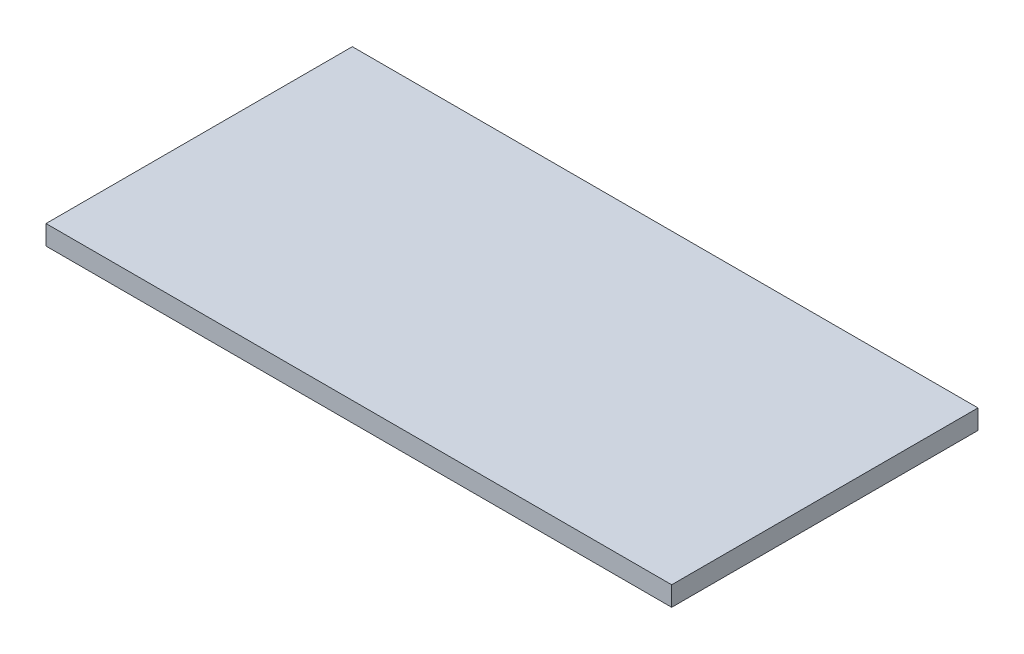
ISO-10303-21;
HEADER;
FILE_DESCRIPTION(('STEP AP214'),'2;1');
FILE_NAME('part.step','',(''),(''),'','','');
FILE_SCHEMA(('AUTOMOTIVE_DESIGN { 1 0 10303 214 1 1 1 1 }'));
ENDSEC;
DATA;
#1=APPLICATION_CONTEXT('core data for automotive mechanical design processes');
#2=APPLICATION_PROTOCOL_DEFINITION('international standard','automotive_design',2000,#1);
#3=PRODUCT_CONTEXT('',#1,'mechanical');
#4=PRODUCT('Part','Part','',(#3));
#5=PRODUCT_RELATED_PRODUCT_CATEGORY('part','',(#4));
#6=PRODUCT_DEFINITION_FORMATION('','',#4);
#7=PRODUCT_DEFINITION_CONTEXT('part definition',#1,'design');
#8=PRODUCT_DEFINITION('design','',#6,#7);
#9=PRODUCT_DEFINITION_SHAPE('','',#8);
#10=(LENGTH_UNIT() NAMED_UNIT(*) SI_UNIT(.MILLI.,.METRE.));
#11=(NAMED_UNIT(*) PLANE_ANGLE_UNIT() SI_UNIT($,.RADIAN.));
#12=(NAMED_UNIT(*) SI_UNIT($,.STERADIAN.) SOLID_ANGLE_UNIT());
#13=UNCERTAINTY_MEASURE_WITH_UNIT(LENGTH_MEASURE(1.E-05),#10,'distance_accuracy_value','');
#14=(GEOMETRIC_REPRESENTATION_CONTEXT(3) GLOBAL_UNCERTAINTY_ASSIGNED_CONTEXT((#13)) GLOBAL_UNIT_ASSIGNED_CONTEXT((#10,
#11,#12)) REPRESENTATION_CONTEXT('',''));
#15=CARTESIAN_POINT('',(0.,0.,0.));
#16=DIRECTION('',(0.,0.,1.));
#17=DIRECTION('',(1.,0.,0.));
#18=AXIS2_PLACEMENT_3D('',#15,#16,#17);
#19=CARTESIAN_POINT('',(-288.,18.,141.));
#20=DIRECTION('',(1.,0.,0.));
#21=DIRECTION('',(0.,0.,-1.));
#22=AXIS2_PLACEMENT_3D('',#19,#20,#21);
#23=PLANE('',#22);
#24=DIRECTION('',(0.,0.,1.));
#25=VECTOR('',#24,1.);
#26=CARTESIAN_POINT('',(-288.,0.,141.));
#27=LINE('',#26,#25);
#28=CARTESIAN_POINT('',(-288.,0.,-141.));
#29=VERTEX_POINT('',#28);
#30=CARTESIAN_POINT('',(-288.,0.,141.));
#31=VERTEX_POINT('',#30);
#32=EDGE_CURVE('E98',#29,#31,#27,.T.);
#33=ORIENTED_EDGE('',*,*,#32,.T.);
#34=DIRECTION('',(0.,-1.,0.));
#35=VECTOR('',#34,1.);
#36=CARTESIAN_POINT('',(-288.,18.,141.));
#37=LINE('',#36,#35);
#38=CARTESIAN_POINT('',(-288.,18.,141.));
#39=VERTEX_POINT('',#38);
#40=EDGE_CURVE('E11',#39,#31,#37,.T.);
#41=ORIENTED_EDGE('',*,*,#40,.F.);
#42=DIRECTION('',(0.,0.,1.));
#43=VECTOR('',#42,1.);
#44=CARTESIAN_POINT('',(-288.,18.,141.));
#45=LINE('',#44,#43);
#46=CARTESIAN_POINT('',(-288.,18.,-141.));
#47=VERTEX_POINT('',#46);
#48=EDGE_CURVE('E86',#47,#39,#45,.T.);
#49=ORIENTED_EDGE('',*,*,#48,.F.);
#50=DIRECTION('',(0.,-1.,0.));
#51=VECTOR('',#50,1.);
#52=CARTESIAN_POINT('',(-288.,18.,-141.));
#53=LINE('',#52,#51);
#54=EDGE_CURVE('E94',#47,#29,#53,.T.);
#55=ORIENTED_EDGE('',*,*,#54,.T.);
#56=EDGE_LOOP('',(#33,#41,#49,#55));
#57=FACE_BOUND('',#56,.T.);
#58=ADVANCED_FACE('F35',(#57),#23,.F.);
#59=CARTESIAN_POINT('',(288.,18.,141.));
#60=DIRECTION('',(0.,0.,-1.));
#61=DIRECTION('',(-1.,0.,0.));
#62=AXIS2_PLACEMENT_3D('',#59,#60,#61);
#63=PLANE('',#62);
#64=DIRECTION('',(1.,0.,0.));
#65=VECTOR('',#64,1.);
#66=CARTESIAN_POINT('',(288.,0.,141.));
#67=LINE('',#66,#65);
#68=CARTESIAN_POINT('',(288.,0.,141.));
#69=VERTEX_POINT('',#68);
#70=EDGE_CURVE('E90',#31,#69,#67,.T.);
#71=ORIENTED_EDGE('',*,*,#70,.T.);
#72=DIRECTION('',(0.,-1.,0.));
#73=VECTOR('',#72,1.);
#74=CARTESIAN_POINT('',(288.,18.,141.));
#75=LINE('',#74,#73);
#76=CARTESIAN_POINT('',(288.,18.,141.));
#77=VERTEX_POINT('',#76);
#78=EDGE_CURVE('E43',#77,#69,#75,.T.);
#79=ORIENTED_EDGE('',*,*,#78,.F.);
#80=DIRECTION('',(1.,0.,0.));
#81=VECTOR('',#80,1.);
#82=CARTESIAN_POINT('',(288.,18.,141.));
#83=LINE('',#82,#81);
#84=EDGE_CURVE('E81',#39,#77,#83,.T.);
#85=ORIENTED_EDGE('',*,*,#84,.F.);
#86=ORIENTED_EDGE('',*,*,#40,.T.);
#87=EDGE_LOOP('',(#71,#79,#85,#86));
#88=FACE_BOUND('',#87,.T.);
#89=ADVANCED_FACE('F89',(#88),#63,.F.);
#90=CARTESIAN_POINT('',(288.,18.,141.));
#91=DIRECTION('',(-1.,0.,0.));
#92=DIRECTION('',(0.,0.,1.));
#93=AXIS2_PLACEMENT_3D('',#90,#91,#92);
#94=PLANE('',#93);
#95=DIRECTION('',(0.,0.,-1.));
#96=VECTOR('',#95,1.);
#97=CARTESIAN_POINT('',(288.,0.,141.));
#98=LINE('',#97,#96);
#99=CARTESIAN_POINT('',(288.,0.,-141.));
#100=VERTEX_POINT('',#99);
#101=EDGE_CURVE('E68',#69,#100,#98,.T.);
#102=ORIENTED_EDGE('',*,*,#101,.T.);
#103=DIRECTION('',(0.,-1.,0.));
#104=VECTOR('',#103,1.);
#105=CARTESIAN_POINT('',(288.,18.,-141.));
#106=LINE('',#105,#104);
#107=CARTESIAN_POINT('',(288.,18.,-141.));
#108=VERTEX_POINT('',#107);
#109=EDGE_CURVE('E91',#108,#100,#106,.T.);
#110=ORIENTED_EDGE('',*,*,#109,.F.);
#111=DIRECTION('',(0.,0.,-1.));
#112=VECTOR('',#111,1.);
#113=CARTESIAN_POINT('',(288.,18.,141.));
#114=LINE('',#113,#112);
#115=EDGE_CURVE('E84',#77,#108,#114,.T.);
#116=ORIENTED_EDGE('',*,*,#115,.F.);
#117=ORIENTED_EDGE('',*,*,#78,.T.);
#118=EDGE_LOOP('',(#102,#110,#116,#117));
#119=FACE_BOUND('',#118,.T.);
#120=ADVANCED_FACE('F92',(#119),#94,.F.);
#121=CARTESIAN_POINT('',(288.,18.,-141.));
#122=DIRECTION('',(0.,0.,1.));
#123=DIRECTION('',(1.,0.,0.));
#124=AXIS2_PLACEMENT_3D('',#121,#122,#123);
#125=PLANE('',#124);
#126=DIRECTION('',(-1.,0.,0.));
#127=VECTOR('',#126,1.);
#128=CARTESIAN_POINT('',(288.,0.,-141.));
#129=LINE('',#128,#127);
#130=EDGE_CURVE('E74',#100,#29,#129,.T.);
#131=ORIENTED_EDGE('',*,*,#130,.T.);
#132=ORIENTED_EDGE('',*,*,#54,.F.);
#133=DIRECTION('',(-1.,0.,0.));
#134=VECTOR('',#133,1.);
#135=CARTESIAN_POINT('',(288.,18.,-141.));
#136=LINE('',#135,#134);
#137=EDGE_CURVE('E51',#108,#47,#136,.T.);
#138=ORIENTED_EDGE('',*,*,#137,.F.);
#139=ORIENTED_EDGE('',*,*,#109,.T.);
#140=EDGE_LOOP('',(#131,#132,#138,#139));
#141=FACE_BOUND('',#140,.T.);
#142=ADVANCED_FACE('F105',(#141),#125,.F.);
#143=CARTESIAN_POINT('',(0.,18.,0.));
#144=DIRECTION('',(0.,1.,0.));
#145=DIRECTION('',(0.,0.,1.));
#146=AXIS2_PLACEMENT_3D('',#143,#144,#145);
#147=PLANE('',#146);
#148=ORIENTED_EDGE('',*,*,#48,.T.);
#149=ORIENTED_EDGE('',*,*,#84,.T.);
#150=ORIENTED_EDGE('',*,*,#115,.T.);
#151=ORIENTED_EDGE('',*,*,#137,.T.);
#152=EDGE_LOOP('',(#148,#149,#150,#151));
#153=FACE_BOUND('',#152,.T.);
#154=ADVANCED_FACE('F82',(#153),#147,.T.);
#155=CARTESIAN_POINT('',(0.,0.,0.));
#156=DIRECTION('',(0.,1.,0.));
#157=DIRECTION('',(0.,0.,1.));
#158=AXIS2_PLACEMENT_3D('',#155,#156,#157);
#159=PLANE('',#158);
#160=ORIENTED_EDGE('',*,*,#32,.F.);
#161=ORIENTED_EDGE('',*,*,#130,.F.);
#162=ORIENTED_EDGE('',*,*,#101,.F.);
#163=ORIENTED_EDGE('',*,*,#70,.F.);
#164=EDGE_LOOP('',(#160,#161,#162,#163));
#165=FACE_BOUND('',#164,.T.);
#166=ADVANCED_FACE('F108',(#165),#159,.F.);
#167=CLOSED_SHELL('',(#58,#89,#120,#142,#154,#166));
#168=MANIFOLD_SOLID_BREP('B2',#167);
#169=ADVANCED_BREP_SHAPE_REPRESENTATION('',(#18,#168),#14);
#170=SHAPE_DEFINITION_REPRESENTATION(#9,#169);
ENDSEC;
END-ISO-10303-21;
